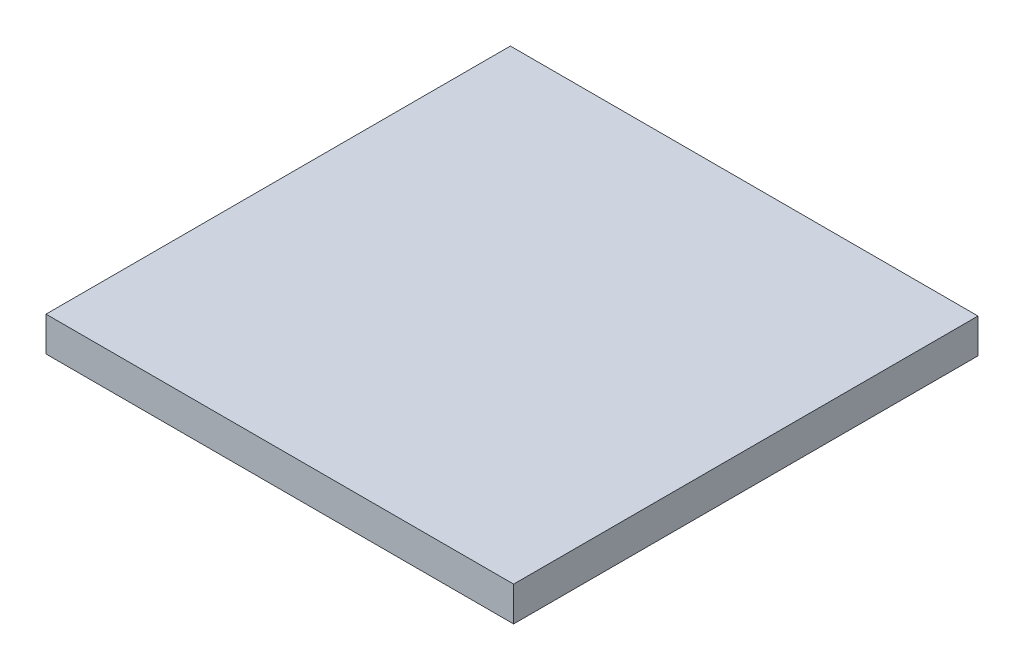
ISO-10303-21;
HEADER;
FILE_DESCRIPTION(('STEP AP214'),'2;1');
FILE_NAME('part.step','',(''),(''),'','','');
FILE_SCHEMA(('AUTOMOTIVE_DESIGN { 1 0 10303 214 1 1 1 1 }'));
ENDSEC;
DATA;
#1=APPLICATION_CONTEXT('core data for automotive mechanical design processes');
#2=APPLICATION_PROTOCOL_DEFINITION('international standard','automotive_design',2000,#1);
#3=PRODUCT_CONTEXT('',#1,'mechanical');
#4=PRODUCT('Part','Part','',(#3));
#5=PRODUCT_RELATED_PRODUCT_CATEGORY('part','',(#4));
#6=PRODUCT_DEFINITION_FORMATION('','',#4);
#7=PRODUCT_DEFINITION_CONTEXT('part definition',#1,'design');
#8=PRODUCT_DEFINITION('design','',#6,#7);
#9=PRODUCT_DEFINITION_SHAPE('','',#8);
#10=(LENGTH_UNIT() NAMED_UNIT(*) SI_UNIT(.MILLI.,.METRE.));
#11=(NAMED_UNIT(*) PLANE_ANGLE_UNIT() SI_UNIT($,.RADIAN.));
#12=(NAMED_UNIT(*) SI_UNIT($,.STERADIAN.) SOLID_ANGLE_UNIT());
#13=UNCERTAINTY_MEASURE_WITH_UNIT(LENGTH_MEASURE(1.E-05),#10,'distance_accuracy_value','');
#14=(GEOMETRIC_REPRESENTATION_CONTEXT(3) GLOBAL_UNCERTAINTY_ASSIGNED_CONTEXT((#13)) GLOBAL_UNIT_ASSIGNED_CONTEXT((#10,
#11,#12)) REPRESENTATION_CONTEXT('',''));
#15=CARTESIAN_POINT('',(0.,0.,0.));
#16=DIRECTION('',(0.,0.,1.));
#17=DIRECTION('',(1.,0.,0.));
#18=AXIS2_PLACEMENT_3D('',#15,#16,#17);
#19=CARTESIAN_POINT('',(-56.2694546566792,2.54,-31.3006308281315));
#20=DIRECTION('',(1.,0.,0.));
#21=DIRECTION('',(0.,0.,-1.));
#22=AXIS2_PLACEMENT_3D('',#19,#20,#21);
#23=PLANE('',#22);
#24=DIRECTION('',(0.,0.,1.));
#25=VECTOR('',#24,1.);
#26=CARTESIAN_POINT('',(-56.2694546566792,0.,-31.3006308281315));
#27=LINE('',#26,#25);
#28=CARTESIAN_POINT('',(-56.2694546566792,0.,-31.3006308281315));
#29=VERTEX_POINT('',#28);
#30=CARTESIAN_POINT('',(-56.2694546566792,0.,2.86723335830213));
#31=VERTEX_POINT('',#30);
#32=EDGE_CURVE('E107',#29,#31,#27,.T.);
#33=ORIENTED_EDGE('',*,*,#32,.T.);
#34=DIRECTION('',(0.,-1.,0.));
#35=VECTOR('',#34,1.);
#36=CARTESIAN_POINT('',(-56.2694546566792,2.54,2.86723335830213));
#37=LINE('',#36,#35);
#38=CARTESIAN_POINT('',(-56.2694546566792,2.54,2.86723335830213));
#39=VERTEX_POINT('',#38);
#40=EDGE_CURVE('E11',#39,#31,#37,.T.);
#41=ORIENTED_EDGE('',*,*,#40,.F.);
#42=DIRECTION('',(0.,0.,1.));
#43=VECTOR('',#42,1.);
#44=CARTESIAN_POINT('',(-56.2694546566792,2.54,-31.3006308281315));
#45=LINE('',#44,#43);
#46=CARTESIAN_POINT('',(-56.2694546566792,2.54,-31.3006308281315));
#47=VERTEX_POINT('',#46);
#48=EDGE_CURVE('E91',#47,#39,#45,.T.);
#49=ORIENTED_EDGE('',*,*,#48,.F.);
#50=DIRECTION('',(0.,-1.,0.));
#51=VECTOR('',#50,1.);
#52=CARTESIAN_POINT('',(-56.2694546566792,2.54,-31.3006308281315));
#53=LINE('',#52,#51);
#54=EDGE_CURVE('E103',#47,#29,#53,.T.);
#55=ORIENTED_EDGE('',*,*,#54,.T.);
#56=EDGE_LOOP('',(#33,#41,#49,#55));
#57=FACE_BOUND('',#56,.T.);
#58=ADVANCED_FACE('F39',(#57),#23,.F.);
#59=CARTESIAN_POINT('',(-56.2694546566792,2.54,2.86723335830213));
#60=DIRECTION('',(0.,0.,-1.));
#61=DIRECTION('',(-1.,0.,0.));
#62=AXIS2_PLACEMENT_3D('',#59,#60,#61);
#63=PLANE('',#62);
#64=DIRECTION('',(1.,0.,0.));
#65=VECTOR('',#64,1.);
#66=CARTESIAN_POINT('',(-56.2694546566792,0.,2.86723335830213));
#67=LINE('',#66,#65);
#68=CARTESIAN_POINT('',(-21.8626543570537,0.,2.86723335830213));
#69=VERTEX_POINT('',#68);
#70=EDGE_CURVE('E96',#31,#69,#67,.T.);
#71=ORIENTED_EDGE('',*,*,#70,.T.);
#72=DIRECTION('',(0.,-1.,0.));
#73=VECTOR('',#72,1.);
#74=CARTESIAN_POINT('',(-21.8626543570537,2.54,2.86723335830213));
#75=LINE('',#74,#73);
#76=CARTESIAN_POINT('',(-21.8626543570537,2.54,2.86723335830213));
#77=VERTEX_POINT('',#76);
#78=EDGE_CURVE('E48',#77,#69,#75,.T.);
#79=ORIENTED_EDGE('',*,*,#78,.F.);
#80=DIRECTION('',(1.,0.,0.));
#81=VECTOR('',#80,1.);
#82=CARTESIAN_POINT('',(-56.2694546566792,2.54,2.86723335830213));
#83=LINE('',#82,#81);
#84=EDGE_CURVE('E86',#39,#77,#83,.T.);
#85=ORIENTED_EDGE('',*,*,#84,.F.);
#86=ORIENTED_EDGE('',*,*,#40,.T.);
#87=EDGE_LOOP('',(#71,#79,#85,#86));
#88=FACE_BOUND('',#87,.T.);
#89=ADVANCED_FACE('F95',(#88),#63,.F.);
#90=CARTESIAN_POINT('',(-21.8626543570537,2.54,-31.3006308281315));
#91=DIRECTION('',(-1.,0.,0.));
#92=DIRECTION('',(0.,0.,1.));
#93=AXIS2_PLACEMENT_3D('',#90,#91,#92);
#94=PLANE('',#93);
#95=DIRECTION('',(0.,0.,-1.));
#96=VECTOR('',#95,1.);
#97=CARTESIAN_POINT('',(-21.8626543570537,0.,-31.3006308281315));
#98=LINE('',#97,#96);
#99=CARTESIAN_POINT('',(-21.8626543570537,0.,-31.3006308281315));
#100=VERTEX_POINT('',#99);
#101=EDGE_CURVE('E73',#69,#100,#98,.T.);
#102=ORIENTED_EDGE('',*,*,#101,.T.);
#103=DIRECTION('',(0.,-1.,0.));
#104=VECTOR('',#103,1.);
#105=CARTESIAN_POINT('',(-21.8626543570537,2.54,-31.3006308281315));
#106=LINE('',#105,#104);
#107=CARTESIAN_POINT('',(-21.8626543570537,2.54,-31.3006308281315));
#108=VERTEX_POINT('',#107);
#109=EDGE_CURVE('E98',#108,#100,#106,.T.);
#110=ORIENTED_EDGE('',*,*,#109,.F.);
#111=DIRECTION('',(0.,0.,-1.));
#112=VECTOR('',#111,1.);
#113=CARTESIAN_POINT('',(-21.8626543570537,2.54,-31.3006308281315));
#114=LINE('',#113,#112);
#115=EDGE_CURVE('E89',#77,#108,#114,.T.);
#116=ORIENTED_EDGE('',*,*,#115,.F.);
#117=ORIENTED_EDGE('',*,*,#78,.T.);
#118=EDGE_LOOP('',(#102,#110,#116,#117));
#119=FACE_BOUND('',#118,.T.);
#120=ADVANCED_FACE('F99',(#119),#94,.F.);
#121=CARTESIAN_POINT('',(-56.2694546566792,2.54,-31.3006308281315));
#122=DIRECTION('',(0.,0.,1.));
#123=DIRECTION('',(1.,0.,0.));
#124=AXIS2_PLACEMENT_3D('',#121,#122,#123);
#125=PLANE('',#124);
#126=DIRECTION('',(-1.,0.,0.));
#127=VECTOR('',#126,1.);
#128=CARTESIAN_POINT('',(-56.2694546566792,0.,-31.3006308281315));
#129=LINE('',#128,#127);
#130=EDGE_CURVE('E79',#100,#29,#129,.T.);
#131=ORIENTED_EDGE('',*,*,#130,.T.);
#132=ORIENTED_EDGE('',*,*,#54,.F.);
#133=DIRECTION('',(-1.,0.,0.));
#134=VECTOR('',#133,1.);
#135=CARTESIAN_POINT('',(-56.2694546566792,2.54,-31.3006308281315));
#136=LINE('',#135,#134);
#137=EDGE_CURVE('E56',#108,#47,#136,.T.);
#138=ORIENTED_EDGE('',*,*,#137,.F.);
#139=ORIENTED_EDGE('',*,*,#109,.T.);
#140=EDGE_LOOP('',(#131,#132,#138,#139));
#141=FACE_BOUND('',#140,.T.);
#142=ADVANCED_FACE('F120',(#141),#125,.F.);
#143=CARTESIAN_POINT('',(0.,2.54,0.));
#144=DIRECTION('',(0.,1.,0.));
#145=DIRECTION('',(0.,0.,1.));
#146=AXIS2_PLACEMENT_3D('',#143,#144,#145);
#147=PLANE('',#146);
#148=ORIENTED_EDGE('',*,*,#48,.T.);
#149=ORIENTED_EDGE('',*,*,#84,.T.);
#150=ORIENTED_EDGE('',*,*,#115,.T.);
#151=ORIENTED_EDGE('',*,*,#137,.T.);
#152=EDGE_LOOP('',(#148,#149,#150,#151));
#153=FACE_BOUND('',#152,.T.);
#154=ADVANCED_FACE('F87',(#153),#147,.T.);
#155=CARTESIAN_POINT('',(0.,0.,0.));
#156=DIRECTION('',(0.,1.,0.));
#157=DIRECTION('',(0.,0.,1.));
#158=AXIS2_PLACEMENT_3D('',#155,#156,#157);
#159=PLANE('',#158);
#160=ORIENTED_EDGE('',*,*,#32,.F.);
#161=ORIENTED_EDGE('',*,*,#130,.F.);
#162=ORIENTED_EDGE('',*,*,#101,.F.);
#163=ORIENTED_EDGE('',*,*,#70,.F.);
#164=EDGE_LOOP('',(#160,#161,#162,#163));
#165=FACE_BOUND('',#164,.T.);
#166=ADVANCED_FACE('F123',(#165),#159,.F.);
#167=CLOSED_SHELL('',(#58,#89,#120,#142,#154,#166));
#168=MANIFOLD_SOLID_BREP('B2',#167);
#169=ADVANCED_BREP_SHAPE_REPRESENTATION('',(#18,#168),#14);
#170=SHAPE_DEFINITION_REPRESENTATION(#9,#169);
ENDSEC;
END-ISO-10303-21;
